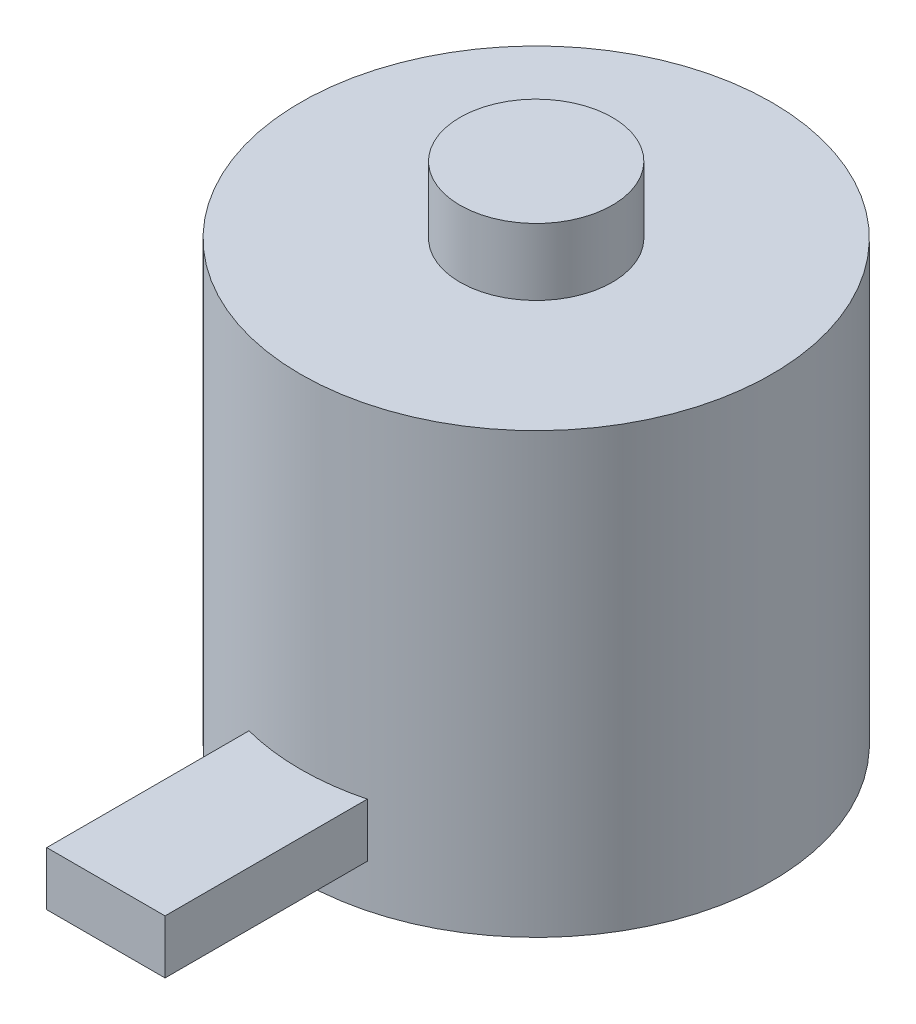
ISO-10303-21;
HEADER;
FILE_DESCRIPTION(('STEP AP214'),'2;1');
FILE_NAME('part.step','',(''),(''),'','','');
FILE_SCHEMA(('AUTOMOTIVE_DESIGN { 1 0 10303 214 1 1 1 1 }'));
ENDSEC;
DATA;
#1=APPLICATION_CONTEXT('core data for automotive mechanical design processes');
#2=APPLICATION_PROTOCOL_DEFINITION('international standard','automotive_design',2000,#1);
#3=PRODUCT_CONTEXT('',#1,'mechanical');
#4=PRODUCT('Part','Part','',(#3));
#5=PRODUCT_RELATED_PRODUCT_CATEGORY('part','',(#4));
#6=PRODUCT_DEFINITION_FORMATION('','',#4);
#7=PRODUCT_DEFINITION_CONTEXT('part definition',#1,'design');
#8=PRODUCT_DEFINITION('design','',#6,#7);
#9=PRODUCT_DEFINITION_SHAPE('','',#8);
#10=(LENGTH_UNIT() NAMED_UNIT(*) SI_UNIT(.MILLI.,.METRE.));
#11=(NAMED_UNIT(*) PLANE_ANGLE_UNIT() SI_UNIT($,.RADIAN.));
#12=(NAMED_UNIT(*) SI_UNIT($,.STERADIAN.) SOLID_ANGLE_UNIT());
#13=UNCERTAINTY_MEASURE_WITH_UNIT(LENGTH_MEASURE(1.E-05),#10,'distance_accuracy_value','');
#14=(GEOMETRIC_REPRESENTATION_CONTEXT(3) GLOBAL_UNCERTAINTY_ASSIGNED_CONTEXT((#13)) GLOBAL_UNIT_ASSIGNED_CONTEXT((#10,
#11,#12)) REPRESENTATION_CONTEXT('',''));
#15=CARTESIAN_POINT('',(0.,0.,0.));
#16=DIRECTION('',(0.,0.,1.));
#17=DIRECTION('',(1.,0.,0.));
#18=AXIS2_PLACEMENT_3D('',#15,#16,#17);
#19=CARTESIAN_POINT('',(0.,14.9225,0.));
#20=DIRECTION('',(0.,-1.,0.));
#21=DIRECTION('',(0.,0.,-1.));
#22=AXIS2_PLACEMENT_3D('',#19,#20,#21);
#23=CYLINDRICAL_SURFACE('',#22,13.9065);
#24=CARTESIAN_POINT('',(0.,10.9855,0.));
#25=DIRECTION('',(0.,1.,0.));
#26=DIRECTION('',(0.,0.,1.));
#27=AXIS2_PLACEMENT_3D('',#24,#25,#26);
#28=CIRCLE('',#27,13.9065);
#29=CARTESIAN_POINT('',(0.,10.9855,13.9065));
#30=VERTEX_POINT('',#29);
#31=EDGE_CURVE('E100',#30,#30,#28,.F.);
#32=ORIENTED_EDGE('',*,*,#31,.T.);
#33=EDGE_LOOP('',(#32));
#34=FACE_BOUND('',#33,.T.);
#35=CARTESIAN_POINT('',(0.,-14.9225,0.));
#36=DIRECTION('',(0.,1.,0.));
#37=DIRECTION('',(0.,0.,1.));
#38=AXIS2_PLACEMENT_3D('',#35,#36,#37);
#39=CIRCLE('',#38,13.9065);
#40=CARTESIAN_POINT('',(0.,-14.9225,13.9065));
#41=VERTEX_POINT('',#40);
#42=EDGE_CURVE('E111',#41,#41,#39,.T.);
#43=ORIENTED_EDGE('',*,*,#42,.T.);
#44=EDGE_LOOP('',(#43));
#45=FACE_BOUND('',#44,.T.);
#46=DIRECTION('',(0.,-1.,0.));
#47=VECTOR('',#46,1.);
#48=CARTESIAN_POINT('',(3.4925,14.9225,13.4608018334719));
#49=LINE('',#48,#47);
#50=CARTESIAN_POINT('',(3.4925,-12.3825,13.4608018334719));
#51=VERTEX_POINT('',#50);
#52=CARTESIAN_POINT('',(3.4925,-9.2075,13.4608018334719));
#53=VERTEX_POINT('',#52);
#54=EDGE_CURVE('E12',#51,#53,#49,.F.);
#55=ORIENTED_EDGE('',*,*,#54,.F.);
#56=CARTESIAN_POINT('',(0.,-12.3825,0.));
#57=DIRECTION('',(0.,1.,0.));
#58=DIRECTION('',(0.,0.,1.));
#59=AXIS2_PLACEMENT_3D('',#56,#57,#58);
#60=CIRCLE('',#59,13.9065);
#61=CARTESIAN_POINT('',(-3.4925,-12.3825,13.4608018334719));
#62=VERTEX_POINT('',#61);
#63=EDGE_CURVE('E114',#62,#51,#60,.T.);
#64=ORIENTED_EDGE('',*,*,#63,.F.);
#65=DIRECTION('',(0.,-1.,0.));
#66=VECTOR('',#65,1.);
#67=CARTESIAN_POINT('',(-3.4925,14.9225,13.4608018334719));
#68=LINE('',#67,#66);
#69=CARTESIAN_POINT('',(-3.4925,-9.2075,13.4608018334719));
#70=VERTEX_POINT('',#69);
#71=EDGE_CURVE('E56',#70,#62,#68,.T.);
#72=ORIENTED_EDGE('',*,*,#71,.F.);
#73=CARTESIAN_POINT('',(0.,-9.2075,0.));
#74=DIRECTION('',(0.,-1.,0.));
#75=DIRECTION('',(0.,0.,-1.));
#76=AXIS2_PLACEMENT_3D('',#73,#74,#75);
#77=CIRCLE('',#76,13.9065);
#78=EDGE_CURVE('E46',#53,#70,#77,.T.);
#79=ORIENTED_EDGE('',*,*,#78,.F.);
#80=EDGE_LOOP('',(#55,#64,#72,#79));
#81=FACE_BOUND('',#80,.T.);
#82=ADVANCED_FACE('F39',(#34,#45,#81),#23,.T.);
#83=CARTESIAN_POINT('',(0.,-14.9225,0.));
#84=DIRECTION('',(0.,1.,0.));
#85=DIRECTION('',(0.,0.,1.));
#86=AXIS2_PLACEMENT_3D('',#83,#84,#85);
#87=PLANE('',#86);
#88=CARTESIAN_POINT('',(-5.65685424949241,-14.9225,5.65685424949235));
#89=DIRECTION('',(0.,-1.,0.));
#90=DIRECTION('',(0.,0.,-1.));
#91=AXIS2_PLACEMENT_3D('',#88,#89,#90);
#92=CIRCLE('',#91,1.5);
#93=CARTESIAN_POINT('',(-5.65685424949241,-14.9225,4.15685424949235));
#94=VERTEX_POINT('',#93);
#95=EDGE_CURVE('E217',#94,#94,#92,.T.);
#96=ORIENTED_EDGE('',*,*,#95,.F.);
#97=EDGE_LOOP('',(#96));
#98=FACE_BOUND('',#97,.T.);
#99=CARTESIAN_POINT('',(5.65685424949241,-14.9225,-5.65685424949235));
#100=DIRECTION('',(0.,-1.,0.));
#101=DIRECTION('',(0.,0.,-1.));
#102=AXIS2_PLACEMENT_3D('',#99,#100,#101);
#103=CIRCLE('',#102,1.5);
#104=CARTESIAN_POINT('',(5.65685424949241,-14.9225,-7.15685424949235));
#105=VERTEX_POINT('',#104);
#106=EDGE_CURVE('E204',#105,#105,#103,.T.);
#107=ORIENTED_EDGE('',*,*,#106,.F.);
#108=EDGE_LOOP('',(#107));
#109=FACE_BOUND('',#108,.T.);
#110=CARTESIAN_POINT('',(-6.71751442127216,-14.9225,-6.71751442127224));
#111=DIRECTION('',(0.,-1.,0.));
#112=DIRECTION('',(0.,0.,-1.));
#113=AXIS2_PLACEMENT_3D('',#110,#111,#112);
#114=CIRCLE('',#113,1.5);
#115=CARTESIAN_POINT('',(-6.71751442127216,-14.9225,-8.21751442127224));
#116=VERTEX_POINT('',#115);
#117=EDGE_CURVE('E205',#116,#116,#114,.T.);
#118=ORIENTED_EDGE('',*,*,#117,.F.);
#119=EDGE_LOOP('',(#118));
#120=FACE_BOUND('',#119,.T.);
#121=CARTESIAN_POINT('',(6.71751442127216,-14.9225,6.71751442127224));
#122=DIRECTION('',(0.,-1.,0.));
#123=DIRECTION('',(0.,0.,-1.));
#124=AXIS2_PLACEMENT_3D('',#121,#122,#123);
#125=CIRCLE('',#124,1.5);
#126=CARTESIAN_POINT('',(6.71751442127216,-14.9225,5.21751442127224));
#127=VERTEX_POINT('',#126);
#128=EDGE_CURVE('E216',#127,#127,#125,.T.);
#129=ORIENTED_EDGE('',*,*,#128,.F.);
#130=EDGE_LOOP('',(#129));
#131=FACE_BOUND('',#130,.T.);
#132=ORIENTED_EDGE('',*,*,#42,.F.);
#133=EDGE_LOOP('',(#132));
#134=FACE_BOUND('',#133,.T.);
#135=ADVANCED_FACE('F128',(#98,#109,#120,#131,#134),#87,.F.);
#136=CARTESIAN_POINT('',(0.,-54.2560218102829,0.));
#137=DIRECTION('',(0.,1.,0.));
#138=DIRECTION('',(0.,0.,1.));
#139=AXIS2_PLACEMENT_3D('',#136,#137,#138);
#140=CYLINDRICAL_SURFACE('',#139,4.4958);
#141=CARTESIAN_POINT('',(0.,10.9855,0.));
#142=DIRECTION('',(0.,1.,0.));
#143=DIRECTION('',(0.,0.,1.));
#144=AXIS2_PLACEMENT_3D('',#141,#142,#143);
#145=CIRCLE('',#144,4.4958);
#146=CARTESIAN_POINT('',(0.,10.9855,4.4958));
#147=VERTEX_POINT('',#146);
#148=EDGE_CURVE('E107',#147,#147,#145,.F.);
#149=ORIENTED_EDGE('',*,*,#148,.F.);
#150=EDGE_LOOP('',(#149));
#151=FACE_BOUND('',#150,.T.);
#152=CARTESIAN_POINT('',(0.,14.9225,0.));
#153=DIRECTION('',(0.,1.,0.));
#154=DIRECTION('',(0.,0.,1.));
#155=AXIS2_PLACEMENT_3D('',#152,#153,#154);
#156=CIRCLE('',#155,4.4958);
#157=CARTESIAN_POINT('',(0.,14.9225,4.4958));
#158=VERTEX_POINT('',#157);
#159=EDGE_CURVE('E97',#158,#158,#156,.T.);
#160=ORIENTED_EDGE('',*,*,#159,.F.);
#161=EDGE_LOOP('',(#160));
#162=FACE_BOUND('',#161,.T.);
#163=ADVANCED_FACE('F134',(#151,#162),#140,.T.);
#164=CARTESIAN_POINT('',(0.,10.9855,0.));
#165=DIRECTION('',(0.,1.,0.));
#166=DIRECTION('',(0.,0.,1.));
#167=AXIS2_PLACEMENT_3D('',#164,#165,#166);
#168=PLANE('',#167);
#169=ORIENTED_EDGE('',*,*,#31,.F.);
#170=EDGE_LOOP('',(#169));
#171=FACE_BOUND('',#170,.T.);
#172=ORIENTED_EDGE('',*,*,#148,.T.);
#173=EDGE_LOOP('',(#172));
#174=FACE_BOUND('',#173,.T.);
#175=ADVANCED_FACE('F141',(#171,#174),#168,.T.);
#176=CARTESIAN_POINT('',(0.,14.9225,0.));
#177=DIRECTION('',(0.,1.,0.));
#178=DIRECTION('',(0.,0.,1.));
#179=AXIS2_PLACEMENT_3D('',#176,#177,#178);
#180=PLANE('',#179);
#181=ORIENTED_EDGE('',*,*,#159,.T.);
#182=EDGE_LOOP('',(#181));
#183=FACE_BOUND('',#182,.T.);
#184=ADVANCED_FACE('F144',(#183),#180,.T.);
#185=CARTESIAN_POINT('',(3.4925,-12.3825,25.4));
#186=DIRECTION('',(-1.,0.,0.));
#187=DIRECTION('',(0.,0.,1.));
#188=AXIS2_PLACEMENT_3D('',#185,#186,#187);
#189=PLANE('',#188);
#190=DIRECTION('',(0.,0.,-1.));
#191=VECTOR('',#190,1.);
#192=CARTESIAN_POINT('',(3.4925,-12.3825,25.4));
#193=LINE('',#192,#191);
#194=CARTESIAN_POINT('',(3.4925,-12.3825,25.4));
#195=VERTEX_POINT('',#194);
#196=EDGE_CURVE('E122',#195,#51,#193,.T.);
#197=ORIENTED_EDGE('',*,*,#196,.T.);
#198=ORIENTED_EDGE('',*,*,#54,.T.);
#199=DIRECTION('',(0.,0.,-1.));
#200=VECTOR('',#199,1.);
#201=CARTESIAN_POINT('',(3.4925,-9.2075,25.4));
#202=LINE('',#201,#200);
#203=CARTESIAN_POINT('',(3.4925,-9.2075,25.4));
#204=VERTEX_POINT('',#203);
#205=EDGE_CURVE('E79',#204,#53,#202,.T.);
#206=ORIENTED_EDGE('',*,*,#205,.F.);
#207=DIRECTION('',(0.,1.,0.));
#208=VECTOR('',#207,1.);
#209=CARTESIAN_POINT('',(3.4925,-12.3825,25.4));
#210=LINE('',#209,#208);
#211=EDGE_CURVE('E85',#195,#204,#210,.T.);
#212=ORIENTED_EDGE('',*,*,#211,.F.);
#213=EDGE_LOOP('',(#197,#198,#206,#212));
#214=FACE_BOUND('',#213,.T.);
#215=ADVANCED_FACE('F96',(#214),#189,.F.);
#216=CARTESIAN_POINT('',(-3.4925,-12.3825,25.4));
#217=DIRECTION('',(1.,0.,0.));
#218=DIRECTION('',(0.,0.,-1.));
#219=AXIS2_PLACEMENT_3D('',#216,#217,#218);
#220=PLANE('',#219);
#221=DIRECTION('',(0.,0.,-1.));
#222=VECTOR('',#221,1.);
#223=CARTESIAN_POINT('',(-3.4925,-9.2075,25.4));
#224=LINE('',#223,#222);
#225=CARTESIAN_POINT('',(-3.4925,-9.2075,25.4));
#226=VERTEX_POINT('',#225);
#227=EDGE_CURVE('E81',#226,#70,#224,.T.);
#228=ORIENTED_EDGE('',*,*,#227,.T.);
#229=ORIENTED_EDGE('',*,*,#71,.T.);
#230=DIRECTION('',(0.,0.,-1.));
#231=VECTOR('',#230,1.);
#232=CARTESIAN_POINT('',(-3.4925,-12.3825,25.4));
#233=LINE('',#232,#231);
#234=CARTESIAN_POINT('',(-3.4925,-12.3825,25.4));
#235=VERTEX_POINT('',#234);
#236=EDGE_CURVE('E102',#235,#62,#233,.T.);
#237=ORIENTED_EDGE('',*,*,#236,.F.);
#238=DIRECTION('',(0.,-1.,0.));
#239=VECTOR('',#238,1.);
#240=CARTESIAN_POINT('',(-3.4925,-12.3825,25.4));
#241=LINE('',#240,#239);
#242=EDGE_CURVE('E84',#226,#235,#241,.T.);
#243=ORIENTED_EDGE('',*,*,#242,.F.);
#244=EDGE_LOOP('',(#228,#229,#237,#243));
#245=FACE_BOUND('',#244,.T.);
#246=ADVANCED_FACE('F118',(#245),#220,.F.);
#247=CARTESIAN_POINT('',(-3.4925,-9.2075,25.4));
#248=DIRECTION('',(0.,-1.,0.));
#249=DIRECTION('',(0.,0.,-1.));
#250=AXIS2_PLACEMENT_3D('',#247,#248,#249);
#251=PLANE('',#250);
#252=ORIENTED_EDGE('',*,*,#205,.T.);
#253=ORIENTED_EDGE('',*,*,#78,.T.);
#254=ORIENTED_EDGE('',*,*,#227,.F.);
#255=DIRECTION('',(-1.,0.,0.));
#256=VECTOR('',#255,1.);
#257=CARTESIAN_POINT('',(-3.4925,-9.2075,25.4));
#258=LINE('',#257,#256);
#259=EDGE_CURVE('E75',#204,#226,#258,.T.);
#260=ORIENTED_EDGE('',*,*,#259,.F.);
#261=EDGE_LOOP('',(#252,#253,#254,#260));
#262=FACE_BOUND('',#261,.T.);
#263=ADVANCED_FACE('F77',(#262),#251,.F.);
#264=CARTESIAN_POINT('',(-3.4925,-12.3825,25.4));
#265=DIRECTION('',(0.,1.,0.));
#266=DIRECTION('',(0.,0.,1.));
#267=AXIS2_PLACEMENT_3D('',#264,#265,#266);
#268=PLANE('',#267);
#269=ORIENTED_EDGE('',*,*,#236,.T.);
#270=ORIENTED_EDGE('',*,*,#63,.T.);
#271=ORIENTED_EDGE('',*,*,#196,.F.);
#272=DIRECTION('',(1.,0.,0.));
#273=VECTOR('',#272,1.);
#274=CARTESIAN_POINT('',(-3.4925,-12.3825,25.4));
#275=LINE('',#274,#273);
#276=EDGE_CURVE('E90',#235,#195,#275,.T.);
#277=ORIENTED_EDGE('',*,*,#276,.F.);
#278=EDGE_LOOP('',(#269,#270,#271,#277));
#279=FACE_BOUND('',#278,.T.);
#280=ADVANCED_FACE('F126',(#279),#268,.F.);
#281=CARTESIAN_POINT('',(0.,0.,25.4));
#282=DIRECTION('',(0.,0.,-1.));
#283=DIRECTION('',(-1.,0.,0.));
#284=AXIS2_PLACEMENT_3D('',#281,#282,#283);
#285=PLANE('',#284);
#286=ORIENTED_EDGE('',*,*,#211,.T.);
#287=ORIENTED_EDGE('',*,*,#259,.T.);
#288=ORIENTED_EDGE('',*,*,#242,.T.);
#289=ORIENTED_EDGE('',*,*,#276,.T.);
#290=EDGE_LOOP('',(#286,#287,#288,#289));
#291=FACE_BOUND('',#290,.T.);
#292=ADVANCED_FACE('F88',(#291),#285,.F.);
#293=CARTESIAN_POINT('',(6.71751442127216,-2.2225,6.71751442127224));
#294=DIRECTION('',(0.,-1.,0.));
#295=DIRECTION('',(0.,0.,-1.));
#296=AXIS2_PLACEMENT_3D('',#293,#294,#295);
#297=CYLINDRICAL_SURFACE('',#296,1.5);
#298=CARTESIAN_POINT('',(6.71751442127216,-2.2225,6.71751442127224));
#299=DIRECTION('',(0.,-1.,0.));
#300=DIRECTION('',(0.,0.,-1.));
#301=AXIS2_PLACEMENT_3D('',#298,#299,#300);
#302=CIRCLE('',#301,1.5);
#303=CARTESIAN_POINT('',(6.71751442127216,-2.2225,5.21751442127224));
#304=VERTEX_POINT('',#303);
#305=EDGE_CURVE('E94',#304,#304,#302,.T.);
#306=ORIENTED_EDGE('',*,*,#305,.F.);
#307=EDGE_LOOP('',(#306));
#308=FACE_BOUND('',#307,.T.);
#309=ORIENTED_EDGE('',*,*,#128,.T.);
#310=EDGE_LOOP('',(#309));
#311=FACE_BOUND('',#310,.T.);
#312=ADVANCED_FACE('F168',(#308,#311),#297,.F.);
#313=CARTESIAN_POINT('',(6.71751442127216,-2.2225,6.71751442127224));
#314=DIRECTION('',(0.,-1.,0.));
#315=DIRECTION('',(0.,0.,-1.));
#316=AXIS2_PLACEMENT_3D('',#313,#314,#315);
#317=PLANE('',#316);
#318=ORIENTED_EDGE('',*,*,#305,.T.);
#319=EDGE_LOOP('',(#318));
#320=FACE_BOUND('',#319,.T.);
#321=ADVANCED_FACE('F171',(#320),#317,.T.);
#322=CARTESIAN_POINT('',(-6.71751442127216,-2.2225,-6.71751442127224));
#323=DIRECTION('',(0.,-1.,0.));
#324=DIRECTION('',(0.,0.,-1.));
#325=AXIS2_PLACEMENT_3D('',#322,#323,#324);
#326=CYLINDRICAL_SURFACE('',#325,1.5);
#327=CARTESIAN_POINT('',(-6.71751442127216,-2.2225,-6.71751442127224));
#328=DIRECTION('',(0.,-1.,0.));
#329=DIRECTION('',(0.,0.,-1.));
#330=AXIS2_PLACEMENT_3D('',#327,#328,#329);
#331=CIRCLE('',#330,1.5);
#332=CARTESIAN_POINT('',(-6.71751442127216,-2.2225,-8.21751442127224));
#333=VERTEX_POINT('',#332);
#334=EDGE_CURVE('E203',#333,#333,#331,.T.);
#335=ORIENTED_EDGE('',*,*,#334,.F.);
#336=EDGE_LOOP('',(#335));
#337=FACE_BOUND('',#336,.T.);
#338=ORIENTED_EDGE('',*,*,#117,.T.);
#339=EDGE_LOOP('',(#338));
#340=FACE_BOUND('',#339,.T.);
#341=ADVANCED_FACE('F175',(#337,#340),#326,.F.);
#342=CARTESIAN_POINT('',(-6.71751442127216,-2.2225,-6.71751442127224));
#343=DIRECTION('',(0.,-1.,0.));
#344=DIRECTION('',(0.,0.,-1.));
#345=AXIS2_PLACEMENT_3D('',#342,#343,#344);
#346=PLANE('',#345);
#347=ORIENTED_EDGE('',*,*,#334,.T.);
#348=EDGE_LOOP('',(#347));
#349=FACE_BOUND('',#348,.T.);
#350=ADVANCED_FACE('F181',(#349),#346,.T.);
#351=CARTESIAN_POINT('',(5.65685424949241,-2.2225,-5.65685424949235));
#352=DIRECTION('',(0.,-1.,0.));
#353=DIRECTION('',(0.,0.,-1.));
#354=AXIS2_PLACEMENT_3D('',#351,#352,#353);
#355=CYLINDRICAL_SURFACE('',#354,1.5);
#356=CARTESIAN_POINT('',(5.65685424949241,-2.2225,-5.65685424949235));
#357=DIRECTION('',(0.,-1.,0.));
#358=DIRECTION('',(0.,0.,-1.));
#359=AXIS2_PLACEMENT_3D('',#356,#357,#358);
#360=CIRCLE('',#359,1.5);
#361=CARTESIAN_POINT('',(5.65685424949241,-2.2225,-7.15685424949235));
#362=VERTEX_POINT('',#361);
#363=EDGE_CURVE('E208',#362,#362,#360,.T.);
#364=ORIENTED_EDGE('',*,*,#363,.F.);
#365=EDGE_LOOP('',(#364));
#366=FACE_BOUND('',#365,.T.);
#367=ORIENTED_EDGE('',*,*,#106,.T.);
#368=EDGE_LOOP('',(#367));
#369=FACE_BOUND('',#368,.T.);
#370=ADVANCED_FACE('F177',(#366,#369),#355,.F.);
#371=CARTESIAN_POINT('',(5.65685424949241,-2.2225,-5.65685424949235));
#372=DIRECTION('',(0.,-1.,0.));
#373=DIRECTION('',(0.,0.,-1.));
#374=AXIS2_PLACEMENT_3D('',#371,#372,#373);
#375=PLANE('',#374);
#376=ORIENTED_EDGE('',*,*,#363,.T.);
#377=EDGE_LOOP('',(#376));
#378=FACE_BOUND('',#377,.T.);
#379=ADVANCED_FACE('F180',(#378),#375,.T.);
#380=CARTESIAN_POINT('',(-5.65685424949241,-2.2225,5.65685424949235));
#381=DIRECTION('',(0.,-1.,0.));
#382=DIRECTION('',(0.,0.,-1.));
#383=AXIS2_PLACEMENT_3D('',#380,#381,#382);
#384=CYLINDRICAL_SURFACE('',#383,1.5);
#385=CARTESIAN_POINT('',(-5.65685424949241,-2.2225,5.65685424949235));
#386=DIRECTION('',(0.,-1.,0.));
#387=DIRECTION('',(0.,0.,-1.));
#388=AXIS2_PLACEMENT_3D('',#385,#386,#387);
#389=CIRCLE('',#388,1.5);
#390=CARTESIAN_POINT('',(-5.65685424949241,-2.2225,4.15685424949235));
#391=VERTEX_POINT('',#390);
#392=EDGE_CURVE('E213',#391,#391,#389,.T.);
#393=ORIENTED_EDGE('',*,*,#392,.F.);
#394=EDGE_LOOP('',(#393));
#395=FACE_BOUND('',#394,.T.);
#396=ORIENTED_EDGE('',*,*,#95,.T.);
#397=EDGE_LOOP('',(#396));
#398=FACE_BOUND('',#397,.T.);
#399=ADVANCED_FACE('F185',(#395,#398),#384,.F.);
#400=CARTESIAN_POINT('',(-5.65685424949241,-2.2225,5.65685424949235));
#401=DIRECTION('',(0.,-1.,0.));
#402=DIRECTION('',(0.,0.,-1.));
#403=AXIS2_PLACEMENT_3D('',#400,#401,#402);
#404=PLANE('',#403);
#405=ORIENTED_EDGE('',*,*,#392,.T.);
#406=EDGE_LOOP('',(#405));
#407=FACE_BOUND('',#406,.T.);
#408=ADVANCED_FACE('F189',(#407),#404,.T.);
#409=CLOSED_SHELL('',(#82,#135,#163,#175,#184,#215,#246,#263,#280,#292,#312,#321,#341,#350,#370,
#379,#399,#408));
#410=MANIFOLD_SOLID_BREP('B2',#409);
#411=ADVANCED_BREP_SHAPE_REPRESENTATION('',(#18,#410),#14);
#412=SHAPE_DEFINITION_REPRESENTATION(#9,#411);
ENDSEC;
END-ISO-10303-21;
